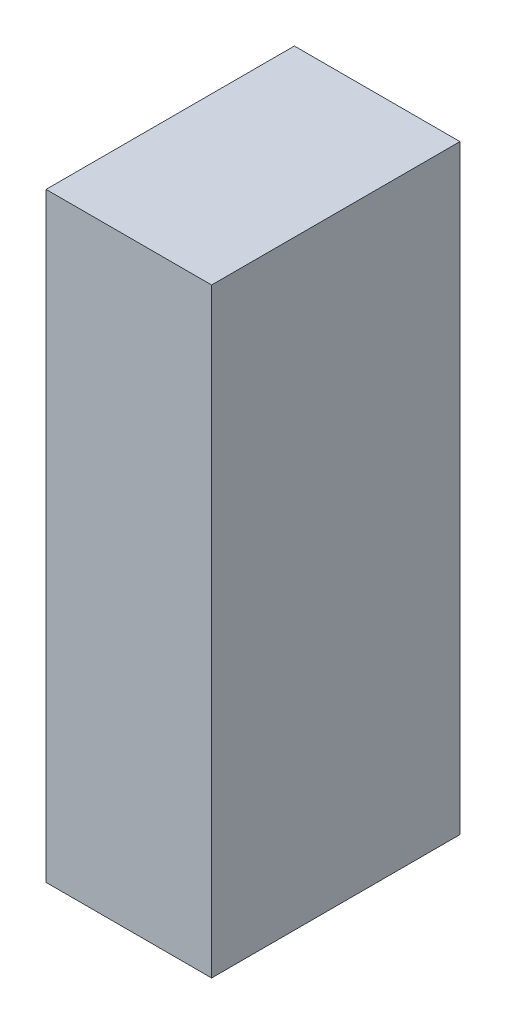
ISO-10303-21;
HEADER;
FILE_DESCRIPTION(('STEP AP214'),'2;1');
FILE_NAME('part.step','',(''),(''),'','','');
FILE_SCHEMA(('AUTOMOTIVE_DESIGN { 1 0 10303 214 1 1 1 1 }'));
ENDSEC;
DATA;
#1=APPLICATION_CONTEXT('core data for automotive mechanical design processes');
#2=APPLICATION_PROTOCOL_DEFINITION('international standard','automotive_design',2000,#1);
#3=PRODUCT_CONTEXT('',#1,'mechanical');
#4=PRODUCT('Part','Part','',(#3));
#5=PRODUCT_RELATED_PRODUCT_CATEGORY('part','',(#4));
#6=PRODUCT_DEFINITION_FORMATION('','',#4);
#7=PRODUCT_DEFINITION_CONTEXT('part definition',#1,'design');
#8=PRODUCT_DEFINITION('design','',#6,#7);
#9=PRODUCT_DEFINITION_SHAPE('','',#8);
#10=(LENGTH_UNIT() NAMED_UNIT(*) SI_UNIT(.MILLI.,.METRE.));
#11=(NAMED_UNIT(*) PLANE_ANGLE_UNIT() SI_UNIT($,.RADIAN.));
#12=(NAMED_UNIT(*) SI_UNIT($,.STERADIAN.) SOLID_ANGLE_UNIT());
#13=UNCERTAINTY_MEASURE_WITH_UNIT(LENGTH_MEASURE(1.E-05),#10,'distance_accuracy_value','');
#14=(GEOMETRIC_REPRESENTATION_CONTEXT(3) GLOBAL_UNCERTAINTY_ASSIGNED_CONTEXT((#13)) GLOBAL_UNIT_ASSIGNED_CONTEXT((#10,
#11,#12)) REPRESENTATION_CONTEXT('',''));
#15=CARTESIAN_POINT('',(0.,0.,0.));
#16=DIRECTION('',(0.,0.,1.));
#17=DIRECTION('',(1.,0.,0.));
#18=AXIS2_PLACEMENT_3D('',#15,#16,#17);
#19=CARTESIAN_POINT('',(-1.10000324273683,0.724992283463422,0.));
#20=DIRECTION('',(-1.,1.19248806385031E-08,0.));
#21=DIRECTION('',(-1.19248806385031E-08,-1.,0.));
#22=AXIS2_PLACEMENT_3D('',#19,#20,#21);
#23=PLANE('',#22);
#24=DIRECTION('',(-1.19248806835723E-08,-1.,0.));
#25=VECTOR('',#24,1.);
#26=CARTESIAN_POINT('',(-1.10000324273683,0.724992283463422,0.));
#27=LINE('',#26,#25);
#28=CARTESIAN_POINT('',(-1.10000324273683,0.724992283463422,0.));
#29=VERTEX_POINT('',#28);
#30=CARTESIAN_POINT('',(-1.10000326002788,-0.725004664778766,0.));
#31=VERTEX_POINT('',#30);
#32=EDGE_CURVE('E11',#29,#31,#27,.T.);
#33=ORIENTED_EDGE('',*,*,#32,.T.);
#34=DIRECTION('',(0.,0.,1.));
#35=VECTOR('',#34,1.);
#36=CARTESIAN_POINT('',(-1.10000326002787,-0.725004664778766,0.));
#37=LINE('',#36,#35);
#38=CARTESIAN_POINT('',(-1.10000326002788,-0.725004664778766,0.599998772144318));
#39=VERTEX_POINT('',#38);
#40=EDGE_CURVE('E88',#31,#39,#37,.T.);
#41=ORIENTED_EDGE('',*,*,#40,.T.);
#42=DIRECTION('',(-1.19248806835723E-08,-1.,0.));
#43=VECTOR('',#42,1.);
#44=CARTESIAN_POINT('',(-1.10000324273683,0.724992283463422,0.599998772144318));
#45=LINE('',#44,#43);
#46=CARTESIAN_POINT('',(-1.10000324273683,0.724992283463422,0.599998772144318));
#47=VERTEX_POINT('',#46);
#48=EDGE_CURVE('E83',#47,#39,#45,.T.);
#49=ORIENTED_EDGE('',*,*,#48,.F.);
#50=DIRECTION('',(0.,0.,1.));
#51=VECTOR('',#50,1.);
#52=CARTESIAN_POINT('',(-1.10000324273683,0.724992283463434,0.));
#53=LINE('',#52,#51);
#54=EDGE_CURVE('E72',#29,#47,#53,.T.);
#55=ORIENTED_EDGE('',*,*,#54,.F.);
#56=EDGE_LOOP('',(#33,#41,#49,#55));
#57=FACE_BOUND('',#56,.T.);
#58=ADVANCED_FACE('F17',(#57),#23,.T.);
#59=CARTESIAN_POINT('',(-1.10000326002788,-0.725004664778766,0.));
#60=DIRECTION('',(-1.19248806385031E-08,-1.,0.));
#61=DIRECTION('',(1.,-1.19248806385031E-08,0.));
#62=AXIS2_PLACEMENT_3D('',#59,#60,#61);
#63=PLANE('',#62);
#64=DIRECTION('',(1.,-1.19248805568155E-08,0.));
#65=VECTOR('',#64,1.);
#66=CARTESIAN_POINT('',(-1.10000326002788,-0.725004664778766,0.));
#67=LINE('',#66,#65);
#68=CARTESIAN_POINT('',(-0.700001734148969,-0.725004669548724,0.));
#69=VERTEX_POINT('',#68);
#70=EDGE_CURVE('E24',#31,#69,#67,.T.);
#71=ORIENTED_EDGE('',*,*,#70,.T.);
#72=DIRECTION('',(0.,0.,1.));
#73=VECTOR('',#72,1.);
#74=CARTESIAN_POINT('',(-0.700001734148969,-0.725004669548736,0.));
#75=LINE('',#74,#73);
#76=CARTESIAN_POINT('',(-0.700001734148969,-0.725004669548724,0.599998772144318));
#77=VERTEX_POINT('',#76);
#78=EDGE_CURVE('E85',#69,#77,#75,.T.);
#79=ORIENTED_EDGE('',*,*,#78,.T.);
#80=DIRECTION('',(1.,-1.19248805568155E-08,0.));
#81=VECTOR('',#80,1.);
#82=CARTESIAN_POINT('',(-1.10000326002788,-0.725004664778766,0.599998772144318));
#83=LINE('',#82,#81);
#84=EDGE_CURVE('E66',#39,#77,#83,.T.);
#85=ORIENTED_EDGE('',*,*,#84,.F.);
#86=ORIENTED_EDGE('',*,*,#40,.F.);
#87=EDGE_LOOP('',(#71,#79,#85,#86));
#88=FACE_BOUND('',#87,.T.);
#89=ADVANCED_FACE('F89',(#88),#63,.T.);
#90=CARTESIAN_POINT('',(-0.700001734148969,-0.725004669548724,0.));
#91=DIRECTION('',(1.,-1.19248806385031E-08,0.));
#92=DIRECTION('',(1.19248806385031E-08,1.,0.));
#93=AXIS2_PLACEMENT_3D('',#90,#91,#92);
#94=PLANE('',#93);
#95=DIRECTION('',(1.1924880607005E-08,1.,0.));
#96=VECTOR('',#95,1.);
#97=CARTESIAN_POINT('',(-0.700001734148969,-0.725004669548724,0.));
#98=LINE('',#97,#96);
#99=CARTESIAN_POINT('',(-0.700001716857926,0.724992278693463,0.));
#100=VERTEX_POINT('',#99);
#101=EDGE_CURVE('E62',#69,#100,#98,.T.);
#102=ORIENTED_EDGE('',*,*,#101,.T.);
#103=DIRECTION('',(0.,0.,1.));
#104=VECTOR('',#103,1.);
#105=CARTESIAN_POINT('',(-0.700001716857929,0.724992278693463,0.));
#106=LINE('',#105,#104);
#107=CARTESIAN_POINT('',(-0.700001716857926,0.724992278693463,0.599998772144318));
#108=VERTEX_POINT('',#107);
#109=EDGE_CURVE('E55',#100,#108,#106,.T.);
#110=ORIENTED_EDGE('',*,*,#109,.T.);
#111=DIRECTION('',(1.1924880607005E-08,1.,0.));
#112=VECTOR('',#111,1.);
#113=CARTESIAN_POINT('',(-0.700001734148969,-0.725004669548724,0.599998772144318));
#114=LINE('',#113,#112);
#115=EDGE_CURVE('E59',#77,#108,#114,.T.);
#116=ORIENTED_EDGE('',*,*,#115,.F.);
#117=ORIENTED_EDGE('',*,*,#78,.F.);
#118=EDGE_LOOP('',(#102,#110,#116,#117));
#119=FACE_BOUND('',#118,.T.);
#120=ADVANCED_FACE('F57',(#119),#94,.T.);
#121=CARTESIAN_POINT('',(-0.700001716857926,0.724992278693463,0.));
#122=DIRECTION('',(1.19248806385031E-08,1.,0.));
#123=DIRECTION('',(-1.,1.19248806385031E-08,0.));
#124=AXIS2_PLACEMENT_3D('',#121,#122,#123);
#125=PLANE('',#124);
#126=DIRECTION('',(-1.,1.19248805568155E-08,0.));
#127=VECTOR('',#126,1.);
#128=CARTESIAN_POINT('',(-0.700001716857926,0.724992278693463,0.));
#129=LINE('',#128,#127);
#130=EDGE_CURVE('E65',#100,#29,#129,.T.);
#131=ORIENTED_EDGE('',*,*,#130,.T.);
#132=ORIENTED_EDGE('',*,*,#54,.T.);
#133=DIRECTION('',(-1.,1.19248805568155E-08,0.));
#134=VECTOR('',#133,1.);
#135=CARTESIAN_POINT('',(-0.700001716857926,0.724992278693463,0.599998772144318));
#136=LINE('',#135,#134);
#137=EDGE_CURVE('E70',#108,#47,#136,.T.);
#138=ORIENTED_EDGE('',*,*,#137,.F.);
#139=ORIENTED_EDGE('',*,*,#109,.F.);
#140=EDGE_LOOP('',(#131,#132,#138,#139));
#141=FACE_BOUND('',#140,.T.);
#142=ADVANCED_FACE('F71',(#141),#125,.T.);
#143=CARTESIAN_POINT('',(119.549995422363,-239.175003051758,0.599998772144318));
#144=DIRECTION('',(0.,0.,1.));
#145=DIRECTION('',(1.19248806385031E-08,1.,0.));
#146=AXIS2_PLACEMENT_3D('',#143,#144,#145);
#147=PLANE('',#146);
#148=ORIENTED_EDGE('',*,*,#48,.T.);
#149=ORIENTED_EDGE('',*,*,#84,.T.);
#150=ORIENTED_EDGE('',*,*,#115,.T.);
#151=ORIENTED_EDGE('',*,*,#137,.T.);
#152=EDGE_LOOP('',(#148,#149,#150,#151));
#153=FACE_BOUND('',#152,.T.);
#154=ADVANCED_FACE('F76',(#153),#147,.T.);
#155=CARTESIAN_POINT('',(119.549995422363,-239.175003051758,0.));
#156=DIRECTION('',(0.,0.,1.));
#157=DIRECTION('',(1.19248806385031E-08,1.,0.));
#158=AXIS2_PLACEMENT_3D('',#155,#156,#157);
#159=PLANE('',#158);
#160=ORIENTED_EDGE('',*,*,#130,.F.);
#161=ORIENTED_EDGE('',*,*,#101,.F.);
#162=ORIENTED_EDGE('',*,*,#70,.F.);
#163=ORIENTED_EDGE('',*,*,#32,.F.);
#164=EDGE_LOOP('',(#160,#161,#162,#163));
#165=FACE_BOUND('',#164,.T.);
#166=ADVANCED_FACE('F91',(#165),#159,.F.);
#167=CLOSED_SHELL('',(#58,#89,#120,#142,#154,#166));
#168=MANIFOLD_SOLID_BREP('B1',#167);
#169=ADVANCED_BREP_SHAPE_REPRESENTATION('',(#18,#168),#14);
#170=SHAPE_DEFINITION_REPRESENTATION(#9,#169);
ENDSEC;
END-ISO-10303-21;
